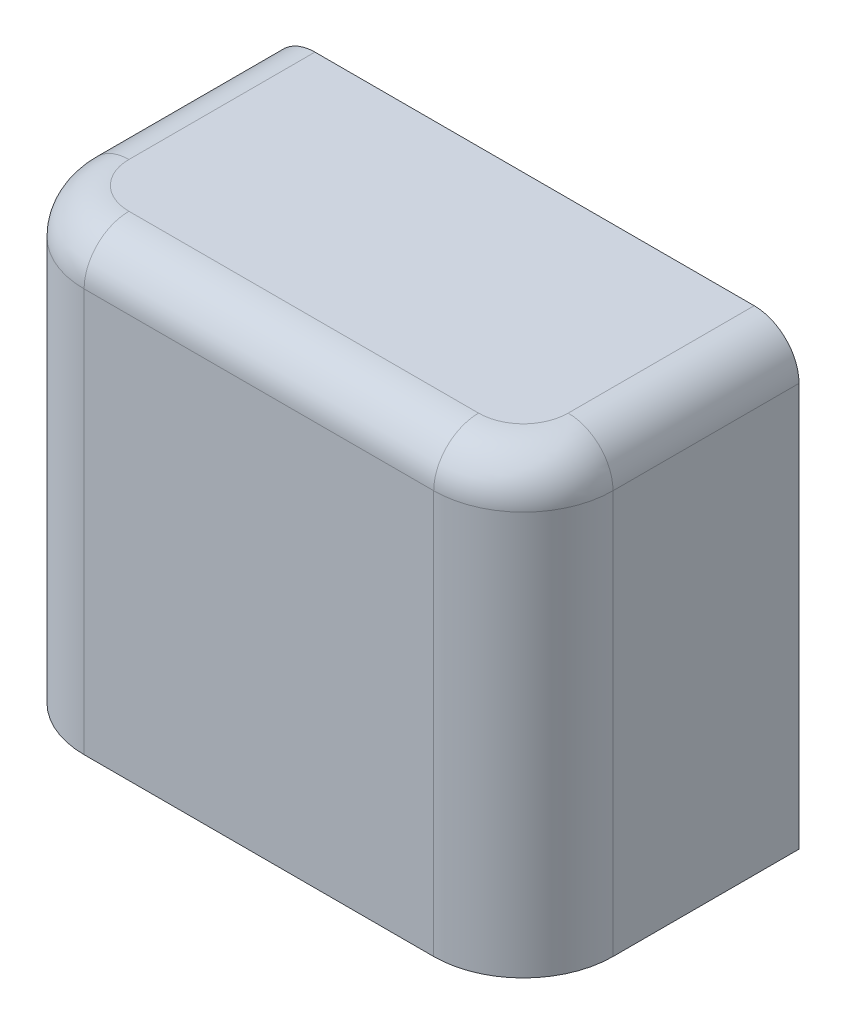
ISO-10303-21;
HEADER;
FILE_DESCRIPTION(('STEP AP214'),'2;1');
FILE_NAME('part.step','',(''),(''),'','','');
FILE_SCHEMA(('AUTOMOTIVE_DESIGN { 1 0 10303 214 1 1 1 1 }'));
ENDSEC;
DATA;
#1=APPLICATION_CONTEXT('core data for automotive mechanical design processes');
#2=APPLICATION_PROTOCOL_DEFINITION('international standard','automotive_design',2000,#1);
#3=PRODUCT_CONTEXT('',#1,'mechanical');
#4=PRODUCT('Part','Part','',(#3));
#5=PRODUCT_RELATED_PRODUCT_CATEGORY('part','',(#4));
#6=PRODUCT_DEFINITION_FORMATION('','',#4);
#7=PRODUCT_DEFINITION_CONTEXT('part definition',#1,'design');
#8=PRODUCT_DEFINITION('design','',#6,#7);
#9=PRODUCT_DEFINITION_SHAPE('','',#8);
#10=(LENGTH_UNIT() NAMED_UNIT(*) SI_UNIT(.MILLI.,.METRE.));
#11=(NAMED_UNIT(*) PLANE_ANGLE_UNIT() SI_UNIT($,.RADIAN.));
#12=(NAMED_UNIT(*) SI_UNIT($,.STERADIAN.) SOLID_ANGLE_UNIT());
#13=UNCERTAINTY_MEASURE_WITH_UNIT(LENGTH_MEASURE(1.E-05),#10,'distance_accuracy_value','');
#14=(GEOMETRIC_REPRESENTATION_CONTEXT(3) GLOBAL_UNCERTAINTY_ASSIGNED_CONTEXT((#13)) GLOBAL_UNIT_ASSIGNED_CONTEXT((#10,
#11,#12)) REPRESENTATION_CONTEXT('',''));
#15=CARTESIAN_POINT('',(0.,0.,0.));
#16=DIRECTION('',(0.,0.,1.));
#17=DIRECTION('',(1.,0.,0.));
#18=AXIS2_PLACEMENT_3D('',#15,#16,#17);
#19=CARTESIAN_POINT('',(124.500000000011,510.,21.4999999999996));
#20=DIRECTION('',(0.,-1.,0.));
#21=DIRECTION('',(0.,0.,-1.));
#22=AXIS2_PLACEMENT_3D('',#19,#20,#21);
#23=CYLINDRICAL_SURFACE('',#22,40.);
#24=DIRECTION('',(0.,-1.,0.));
#25=VECTOR('',#24,1.);
#26=CARTESIAN_POINT('',(164.500000000011,510.,21.4999999999993));
#27=LINE('',#26,#25);
#28=CARTESIAN_POINT('',(164.500000000011,490.,21.4999999999993));
#29=VERTEX_POINT('',#28);
#30=CARTESIAN_POINT('',(164.500000000011,310.,21.4999999999993));
#31=VERTEX_POINT('',#30);
#32=EDGE_CURVE('E89',#29,#31,#27,.T.);
#33=ORIENTED_EDGE('',*,*,#32,.F.);
#34=CARTESIAN_POINT('',(124.500000000011,490.,21.4999999999996));
#35=DIRECTION('',(0.,1.,0.));
#36=DIRECTION('',(0.,0.,1.));
#37=AXIS2_PLACEMENT_3D('',#34,#35,#36);
#38=CIRCLE('',#37,40.);
#39=CARTESIAN_POINT('',(124.50000000001,490.,61.5));
#40=VERTEX_POINT('',#39);
#41=EDGE_CURVE('E152',#29,#40,#38,.F.);
#42=ORIENTED_EDGE('',*,*,#41,.T.);
#43=DIRECTION('',(0.,-1.,0.));
#44=VECTOR('',#43,1.);
#45=CARTESIAN_POINT('',(124.50000000001,510.,61.5));
#46=LINE('',#45,#44);
#47=CARTESIAN_POINT('',(124.50000000001,310.,61.5));
#48=VERTEX_POINT('',#47);
#49=EDGE_CURVE('E112',#40,#48,#46,.T.);
#50=ORIENTED_EDGE('',*,*,#49,.T.);
#51=CARTESIAN_POINT('',(124.500000000011,310.,21.4999999999996));
#52=DIRECTION('',(0.,1.,0.));
#53=DIRECTION('',(0.,0.,1.));
#54=AXIS2_PLACEMENT_3D('',#51,#52,#53);
#55=CIRCLE('',#54,40.);
#56=EDGE_CURVE('E107',#48,#31,#55,.T.);
#57=ORIENTED_EDGE('',*,*,#56,.T.);
#58=EDGE_LOOP('',(#33,#42,#50,#57));
#59=FACE_BOUND('',#58,.T.);
#60=ADVANCED_FACE('F17',(#59),#23,.T.);
#61=CARTESIAN_POINT('',(164.500000000011,510.,21.4999999999993));
#62=DIRECTION('',(-1.,0.,0.));
#63=DIRECTION('',(0.,0.,1.));
#64=AXIS2_PLACEMENT_3D('',#61,#62,#63);
#65=PLANE('',#64);
#66=DIRECTION('',(0.,-1.,0.));
#67=VECTOR('',#66,1.);
#68=CARTESIAN_POINT('',(164.500000000011,510.,-61.5));
#69=LINE('',#68,#67);
#70=CARTESIAN_POINT('',(164.500000000011,490.,-61.5));
#71=VERTEX_POINT('',#70);
#72=CARTESIAN_POINT('',(164.500000000011,310.,-61.5));
#73=VERTEX_POINT('',#72);
#74=EDGE_CURVE('E101',#71,#73,#69,.T.);
#75=ORIENTED_EDGE('',*,*,#74,.F.);
#76=DIRECTION('',(0.,0.,-1.));
#77=VECTOR('',#76,1.);
#78=CARTESIAN_POINT('',(164.500000000011,490.,21.4999999999993));
#79=LINE('',#78,#77);
#80=EDGE_CURVE('E96',#71,#29,#79,.F.);
#81=ORIENTED_EDGE('',*,*,#80,.T.);
#82=ORIENTED_EDGE('',*,*,#32,.T.);
#83=DIRECTION('',(0.,0.,-1.));
#84=VECTOR('',#83,1.);
#85=CARTESIAN_POINT('',(164.500000000011,310.,21.4999999999993));
#86=LINE('',#85,#84);
#87=EDGE_CURVE('E93',#31,#73,#86,.T.);
#88=ORIENTED_EDGE('',*,*,#87,.T.);
#89=EDGE_LOOP('',(#75,#81,#82,#88));
#90=FACE_BOUND('',#89,.T.);
#91=ADVANCED_FACE('F92',(#90),#65,.F.);
#92=CARTESIAN_POINT('',(-71.4999999999913,510.,-61.4999999999976));
#93=DIRECTION('',(0.,0.,1.));
#94=DIRECTION('',(1.,0.,0.));
#95=AXIS2_PLACEMENT_3D('',#92,#93,#94);
#96=PLANE('',#95);
#97=DIRECTION('',(-1.,0.,0.));
#98=VECTOR('',#97,1.);
#99=CARTESIAN_POINT('',(-71.4999999999913,510.,-61.4999999999976));
#100=LINE('',#99,#98);
#101=CARTESIAN_POINT('',(144.500000000011,510.,-61.5));
#102=VERTEX_POINT('',#101);
#103=CARTESIAN_POINT('',(-51.4999999999913,510.,-61.4999999999978));
#104=VERTEX_POINT('',#103);
#105=EDGE_CURVE('E118',#102,#104,#100,.T.);
#106=ORIENTED_EDGE('',*,*,#105,.F.);
#107=CARTESIAN_POINT('',(144.500000000011,490.,-61.5));
#108=DIRECTION('',(0.,0.,1.));
#109=DIRECTION('',(1.,0.,0.));
#110=AXIS2_PLACEMENT_3D('',#107,#108,#109);
#111=CIRCLE('',#110,20.);
#112=EDGE_CURVE('E149',#102,#71,#111,.F.);
#113=ORIENTED_EDGE('',*,*,#112,.T.);
#114=ORIENTED_EDGE('',*,*,#74,.T.);
#115=DIRECTION('',(-1.,0.,0.));
#116=VECTOR('',#115,1.);
#117=CARTESIAN_POINT('',(-71.4999999999913,310.,-61.4999999999976));
#118=LINE('',#117,#116);
#119=CARTESIAN_POINT('',(-71.4999999999913,310.,-61.4999999999976));
#120=VERTEX_POINT('',#119);
#121=EDGE_CURVE('E110',#73,#120,#118,.T.);
#122=ORIENTED_EDGE('',*,*,#121,.T.);
#123=DIRECTION('',(0.,-1.,0.));
#124=VECTOR('',#123,1.);
#125=CARTESIAN_POINT('',(-71.4999999999913,510.,-61.4999999999976));
#126=LINE('',#125,#124);
#127=CARTESIAN_POINT('',(-71.4999999999913,490.,-61.4999999999976));
#128=VERTEX_POINT('',#127);
#129=EDGE_CURVE('E134',#128,#120,#126,.T.);
#130=ORIENTED_EDGE('',*,*,#129,.F.);
#131=CARTESIAN_POINT('',(-51.4999999999913,490.,-61.4999999999978));
#132=DIRECTION('',(0.,0.,1.));
#133=DIRECTION('',(1.,0.,0.));
#134=AXIS2_PLACEMENT_3D('',#131,#132,#133);
#135=CIRCLE('',#134,20.);
#136=EDGE_CURVE('E147',#128,#104,#135,.F.);
#137=ORIENTED_EDGE('',*,*,#136,.T.);
#138=EDGE_LOOP('',(#106,#113,#114,#122,#130,#137));
#139=FACE_BOUND('',#138,.T.);
#140=ADVANCED_FACE('F180',(#139),#96,.F.);
#141=CARTESIAN_POINT('',(-71.4999999999898,510.,21.4999999999985));
#142=DIRECTION('',(1.,0.,0.));
#143=DIRECTION('',(0.,0.,-1.));
#144=AXIS2_PLACEMENT_3D('',#141,#142,#143);
#145=PLANE('',#144);
#146=DIRECTION('',(0.,-1.,0.));
#147=VECTOR('',#146,1.);
#148=CARTESIAN_POINT('',(-71.4999999999898,510.,21.4999999999985));
#149=LINE('',#148,#147);
#150=CARTESIAN_POINT('',(-71.4999999999898,490.,21.4999999999985));
#151=VERTEX_POINT('',#150);
#152=CARTESIAN_POINT('',(-71.4999999999898,310.,21.4999999999985));
#153=VERTEX_POINT('',#152);
#154=EDGE_CURVE('E132',#151,#153,#149,.T.);
#155=ORIENTED_EDGE('',*,*,#154,.F.);
#156=DIRECTION('',(0.,0.,1.));
#157=VECTOR('',#156,1.);
#158=CARTESIAN_POINT('',(-71.4999999999913,490.,-61.4999999999976));
#159=LINE('',#158,#157);
#160=EDGE_CURVE('E11',#151,#128,#159,.F.);
#161=ORIENTED_EDGE('',*,*,#160,.T.);
#162=ORIENTED_EDGE('',*,*,#129,.T.);
#163=DIRECTION('',(0.,0.,1.));
#164=VECTOR('',#163,1.);
#165=CARTESIAN_POINT('',(-71.4999999999898,310.,21.4999999999985));
#166=LINE('',#165,#164);
#167=EDGE_CURVE('E121',#120,#153,#166,.T.);
#168=ORIENTED_EDGE('',*,*,#167,.T.);
#169=EDGE_LOOP('',(#155,#161,#162,#168));
#170=FACE_BOUND('',#169,.T.);
#171=ADVANCED_FACE('F177',(#170),#145,.F.);
#172=CARTESIAN_POINT('',(-31.4999999999898,510.,21.499999999998));
#173=DIRECTION('',(0.,-1.,0.));
#174=DIRECTION('',(0.,0.,-1.));
#175=AXIS2_PLACEMENT_3D('',#172,#173,#174);
#176=CYLINDRICAL_SURFACE('',#175,40.);
#177=DIRECTION('',(0.,-1.,0.));
#178=VECTOR('',#177,1.);
#179=CARTESIAN_POINT('',(-31.4999999999898,510.,61.499999999998));
#180=LINE('',#179,#178);
#181=CARTESIAN_POINT('',(-31.4999999999898,490.,61.499999999998));
#182=VERTEX_POINT('',#181);
#183=CARTESIAN_POINT('',(-31.4999999999898,310.,61.499999999998));
#184=VERTEX_POINT('',#183);
#185=EDGE_CURVE('E130',#182,#184,#180,.T.);
#186=ORIENTED_EDGE('',*,*,#185,.F.);
#187=CARTESIAN_POINT('',(-31.4999999999898,490.,21.499999999998));
#188=DIRECTION('',(0.,1.,0.));
#189=DIRECTION('',(0.,0.,1.));
#190=AXIS2_PLACEMENT_3D('',#187,#188,#189);
#191=CIRCLE('',#190,40.);
#192=EDGE_CURVE('E26',#182,#151,#191,.F.);
#193=ORIENTED_EDGE('',*,*,#192,.T.);
#194=ORIENTED_EDGE('',*,*,#154,.T.);
#195=CARTESIAN_POINT('',(-31.4999999999898,310.,21.499999999998));
#196=DIRECTION('',(0.,1.,0.));
#197=DIRECTION('',(0.,0.,1.));
#198=AXIS2_PLACEMENT_3D('',#195,#196,#197);
#199=CIRCLE('',#198,40.);
#200=EDGE_CURVE('E124',#153,#184,#199,.T.);
#201=ORIENTED_EDGE('',*,*,#200,.T.);
#202=EDGE_LOOP('',(#186,#193,#194,#201));
#203=FACE_BOUND('',#202,.T.);
#204=ADVANCED_FACE('F183',(#203),#176,.T.);
#205=CARTESIAN_POINT('',(-31.4999999999899,510.,61.499999999998));
#206=DIRECTION('',(0.,0.,-1.));
#207=DIRECTION('',(-1.,0.,0.));
#208=AXIS2_PLACEMENT_3D('',#205,#206,#207);
#209=PLANE('',#208);
#210=ORIENTED_EDGE('',*,*,#49,.F.);
#211=DIRECTION('',(1.,0.,0.));
#212=VECTOR('',#211,1.);
#213=CARTESIAN_POINT('',(-31.4999999999898,490.,61.499999999998));
#214=LINE('',#213,#212);
#215=EDGE_CURVE('E41',#40,#182,#214,.F.);
#216=ORIENTED_EDGE('',*,*,#215,.T.);
#217=ORIENTED_EDGE('',*,*,#185,.T.);
#218=DIRECTION('',(1.,0.,0.));
#219=VECTOR('',#218,1.);
#220=CARTESIAN_POINT('',(-31.4999999999899,310.,61.499999999998));
#221=LINE('',#220,#219);
#222=EDGE_CURVE('E127',#184,#48,#221,.T.);
#223=ORIENTED_EDGE('',*,*,#222,.T.);
#224=EDGE_LOOP('',(#210,#216,#217,#223));
#225=FACE_BOUND('',#224,.T.);
#226=ADVANCED_FACE('F184',(#225),#209,.F.);
#227=CARTESIAN_POINT('',(124.500000000011,510.,21.4999999999996));
#228=DIRECTION('',(0.,1.,0.));
#229=DIRECTION('',(0.,0.,1.));
#230=AXIS2_PLACEMENT_3D('',#227,#228,#229);
#231=PLANE('',#230);
#232=CARTESIAN_POINT('',(124.500000000011,510.,21.4999999999996));
#233=DIRECTION('',(0.,1.,0.));
#234=DIRECTION('',(0.,0.,1.));
#235=AXIS2_PLACEMENT_3D('',#232,#233,#234);
#236=CIRCLE('',#235,20.);
#237=CARTESIAN_POINT('',(124.500000000011,510.,41.5));
#238=VERTEX_POINT('',#237);
#239=CARTESIAN_POINT('',(144.500000000011,510.,21.4999999999993));
#240=VERTEX_POINT('',#239);
#241=EDGE_CURVE('E142',#238,#240,#236,.T.);
#242=ORIENTED_EDGE('',*,*,#241,.T.);
#243=DIRECTION('',(0.,0.,-1.));
#244=VECTOR('',#243,1.);
#245=CARTESIAN_POINT('',(144.500000000011,510.,-61.5));
#246=LINE('',#245,#244);
#247=EDGE_CURVE('E144',#240,#102,#246,.T.);
#248=ORIENTED_EDGE('',*,*,#247,.T.);
#249=ORIENTED_EDGE('',*,*,#105,.T.);
#250=DIRECTION('',(0.,0.,1.));
#251=VECTOR('',#250,1.);
#252=CARTESIAN_POINT('',(-51.4999999999898,510.,21.4999999999981));
#253=LINE('',#252,#251);
#254=CARTESIAN_POINT('',(-51.4999999999898,510.,21.4999999999982));
#255=VERTEX_POINT('',#254);
#256=EDGE_CURVE('E100',#104,#255,#253,.T.);
#257=ORIENTED_EDGE('',*,*,#256,.T.);
#258=CARTESIAN_POINT('',(-31.4999999999898,510.,21.499999999998));
#259=DIRECTION('',(0.,1.,0.));
#260=DIRECTION('',(0.,0.,1.));
#261=AXIS2_PLACEMENT_3D('',#258,#259,#260);
#262=CIRCLE('',#261,20.);
#263=CARTESIAN_POINT('',(-31.4999999999896,510.,41.499999999998));
#264=VERTEX_POINT('',#263);
#265=EDGE_CURVE('E138',#255,#264,#262,.T.);
#266=ORIENTED_EDGE('',*,*,#265,.T.);
#267=DIRECTION('',(1.,0.,0.));
#268=VECTOR('',#267,1.);
#269=CARTESIAN_POINT('',(124.50000000001,510.,41.5));
#270=LINE('',#269,#268);
#271=EDGE_CURVE('E140',#264,#238,#270,.T.);
#272=ORIENTED_EDGE('',*,*,#271,.T.);
#273=EDGE_LOOP('',(#242,#248,#249,#257,#266,#272));
#274=FACE_BOUND('',#273,.T.);
#275=ADVANCED_FACE('F186',(#274),#231,.T.);
#276=CARTESIAN_POINT('',(124.500000000011,310.,21.4999999999996));
#277=DIRECTION('',(0.,1.,0.));
#278=DIRECTION('',(0.,0.,1.));
#279=AXIS2_PLACEMENT_3D('',#276,#277,#278);
#280=PLANE('',#279);
#281=ORIENTED_EDGE('',*,*,#56,.F.);
#282=ORIENTED_EDGE('',*,*,#222,.F.);
#283=ORIENTED_EDGE('',*,*,#200,.F.);
#284=ORIENTED_EDGE('',*,*,#167,.F.);
#285=ORIENTED_EDGE('',*,*,#121,.F.);
#286=ORIENTED_EDGE('',*,*,#87,.F.);
#287=EDGE_LOOP('',(#281,#282,#283,#284,#285,#286));
#288=FACE_BOUND('',#287,.T.);
#289=ADVANCED_FACE('F105',(#288),#280,.F.);
#290=CARTESIAN_POINT('',(-51.4999999999898,490.,21.5000000000029));
#291=DIRECTION('',(0.,0.,-1.));
#292=DIRECTION('',(-1.,0.,0.));
#293=AXIS2_PLACEMENT_3D('',#290,#291,#292);
#294=CYLINDRICAL_SURFACE('',#293,20.);
#295=ORIENTED_EDGE('',*,*,#136,.F.);
#296=ORIENTED_EDGE('',*,*,#160,.F.);
#297=CARTESIAN_POINT('',(-51.4999999999898,490.,21.4999999999982));
#298=DIRECTION('',(0.,0.,1.));
#299=DIRECTION('',(1.,0.,0.));
#300=AXIS2_PLACEMENT_3D('',#297,#298,#299);
#301=CIRCLE('',#300,20.);
#302=EDGE_CURVE('E21',#255,#151,#301,.T.);
#303=ORIENTED_EDGE('',*,*,#302,.F.);
#304=ORIENTED_EDGE('',*,*,#256,.F.);
#305=EDGE_LOOP('',(#295,#296,#303,#304));
#306=FACE_BOUND('',#305,.T.);
#307=ADVANCED_FACE('F19',(#306),#294,.T.);
#308=CARTESIAN_POINT('',(-31.4999999999898,490.,21.499999999998));
#309=DIRECTION('',(0.,1.,0.));
#310=DIRECTION('',(0.,0.,1.));
#311=AXIS2_PLACEMENT_3D('',#308,#309,#310);
#312=DEGENERATE_TOROIDAL_SURFACE('',#311,20.,20.,.T.);
#313=ORIENTED_EDGE('',*,*,#302,.T.);
#314=ORIENTED_EDGE('',*,*,#192,.F.);
#315=CARTESIAN_POINT('',(-31.4999999999896,490.,41.499999999998));
#316=DIRECTION('',(1.,0.,0.));
#317=DIRECTION('',(0.,0.,-1.));
#318=AXIS2_PLACEMENT_3D('',#315,#316,#317);
#319=CIRCLE('',#318,20.);
#320=EDGE_CURVE('E116',#264,#182,#319,.T.);
#321=ORIENTED_EDGE('',*,*,#320,.F.);
#322=ORIENTED_EDGE('',*,*,#265,.F.);
#323=EDGE_LOOP('',(#313,#314,#321,#322));
#324=FACE_BOUND('',#323,.T.);
#325=ADVANCED_FACE('F169',(#324),#312,.T.);
#326=CARTESIAN_POINT('',(124.500000000011,490.,41.5));
#327=DIRECTION('',(-1.,0.,0.));
#328=DIRECTION('',(0.,0.,1.));
#329=AXIS2_PLACEMENT_3D('',#326,#327,#328);
#330=CYLINDRICAL_SURFACE('',#329,20.);
#331=ORIENTED_EDGE('',*,*,#320,.T.);
#332=ORIENTED_EDGE('',*,*,#215,.F.);
#333=CARTESIAN_POINT('',(124.500000000011,490.,41.5));
#334=DIRECTION('',(1.,0.,0.));
#335=DIRECTION('',(0.,0.,-1.));
#336=AXIS2_PLACEMENT_3D('',#333,#334,#335);
#337=CIRCLE('',#336,20.);
#338=EDGE_CURVE('E159',#238,#40,#337,.T.);
#339=ORIENTED_EDGE('',*,*,#338,.F.);
#340=ORIENTED_EDGE('',*,*,#271,.F.);
#341=EDGE_LOOP('',(#331,#332,#339,#340));
#342=FACE_BOUND('',#341,.T.);
#343=ADVANCED_FACE('F165',(#342),#330,.T.);
#344=CARTESIAN_POINT('',(124.500000000011,490.,21.4999999999996));
#345=DIRECTION('',(0.,1.,0.));
#346=DIRECTION('',(0.,0.,1.));
#347=AXIS2_PLACEMENT_3D('',#344,#345,#346);
#348=DEGENERATE_TOROIDAL_SURFACE('',#347,20.,20.,.T.);
#349=ORIENTED_EDGE('',*,*,#338,.T.);
#350=ORIENTED_EDGE('',*,*,#41,.F.);
#351=CARTESIAN_POINT('',(144.500000000011,490.,21.4999999999993));
#352=DIRECTION('',(0.,0.,-1.));
#353=DIRECTION('',(-1.,0.,0.));
#354=AXIS2_PLACEMENT_3D('',#351,#352,#353);
#355=CIRCLE('',#354,20.);
#356=EDGE_CURVE('E156',#240,#29,#355,.T.);
#357=ORIENTED_EDGE('',*,*,#356,.F.);
#358=ORIENTED_EDGE('',*,*,#241,.F.);
#359=EDGE_LOOP('',(#349,#350,#357,#358));
#360=FACE_BOUND('',#359,.T.);
#361=ADVANCED_FACE('F210',(#360),#348,.T.);
#362=CARTESIAN_POINT('',(144.500000000011,490.,21.4999999999996));
#363=DIRECTION('',(0.,0.,1.));
#364=DIRECTION('',(1.,0.,0.));
#365=AXIS2_PLACEMENT_3D('',#362,#363,#364);
#366=CYLINDRICAL_SURFACE('',#365,20.);
#367=ORIENTED_EDGE('',*,*,#356,.T.);
#368=ORIENTED_EDGE('',*,*,#80,.F.);
#369=ORIENTED_EDGE('',*,*,#112,.F.);
#370=ORIENTED_EDGE('',*,*,#247,.F.);
#371=EDGE_LOOP('',(#367,#368,#369,#370));
#372=FACE_BOUND('',#371,.T.);
#373=ADVANCED_FACE('F207',(#372),#366,.T.);
#374=CLOSED_SHELL('',(#60,#91,#140,#171,#204,#226,#275,#289,#307,#325,#343,#361,#373));
#375=MANIFOLD_SOLID_BREP('B1',#374);
#376=ADVANCED_BREP_SHAPE_REPRESENTATION('',(#18,#375),#14);
#377=SHAPE_DEFINITION_REPRESENTATION(#9,#376);
ENDSEC;
END-ISO-10303-21;
